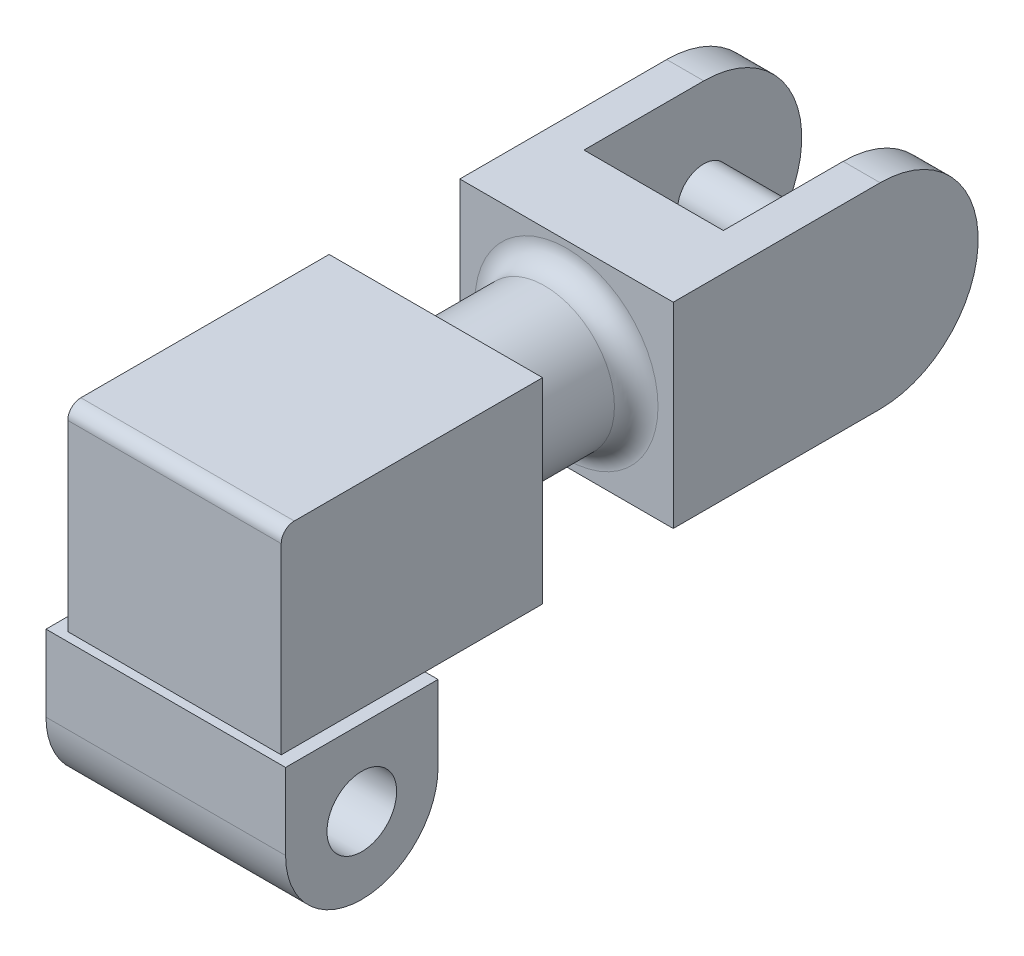
ISO-10303-21;
HEADER;
FILE_DESCRIPTION(('STEP AP214'),'2;1');
FILE_NAME('part.step','',(''),(''),'','','');
FILE_SCHEMA(('AUTOMOTIVE_DESIGN { 1 0 10303 214 1 1 1 1 }'));
ENDSEC;
DATA;
#1=APPLICATION_CONTEXT('core data for automotive mechanical design processes');
#2=APPLICATION_PROTOCOL_DEFINITION('international standard','automotive_design',2000,#1);
#3=PRODUCT_CONTEXT('',#1,'mechanical');
#4=PRODUCT('Part','Part','',(#3));
#5=PRODUCT_RELATED_PRODUCT_CATEGORY('part','',(#4));
#6=PRODUCT_DEFINITION_FORMATION('','',#4);
#7=PRODUCT_DEFINITION_CONTEXT('part definition',#1,'design');
#8=PRODUCT_DEFINITION('design','',#6,#7);
#9=PRODUCT_DEFINITION_SHAPE('','',#8);
#10=(LENGTH_UNIT() NAMED_UNIT(*) SI_UNIT(.MILLI.,.METRE.));
#11=(NAMED_UNIT(*) PLANE_ANGLE_UNIT() SI_UNIT($,.RADIAN.));
#12=(NAMED_UNIT(*) SI_UNIT($,.STERADIAN.) SOLID_ANGLE_UNIT());
#13=UNCERTAINTY_MEASURE_WITH_UNIT(LENGTH_MEASURE(1.E-05),#10,'distance_accuracy_value','');
#14=(GEOMETRIC_REPRESENTATION_CONTEXT(3) GLOBAL_UNCERTAINTY_ASSIGNED_CONTEXT((#13)) GLOBAL_UNIT_ASSIGNED_CONTEXT((#10,
#11,#12)) REPRESENTATION_CONTEXT('',''));
#15=CARTESIAN_POINT('',(0.,0.,0.));
#16=DIRECTION('',(0.,0.,1.));
#17=DIRECTION('',(1.,0.,0.));
#18=AXIS2_PLACEMENT_3D('',#15,#16,#17);
#19=CARTESIAN_POINT('',(-24.5,40.,-122.));
#20=DIRECTION('',(1.,0.,0.));
#21=DIRECTION('',(0.,0.,-1.));
#22=AXIS2_PLACEMENT_3D('',#19,#20,#21);
#23=CYLINDRICAL_SURFACE('',#22,22.5);
#24=DIRECTION('',(-1.,0.,0.));
#25=VECTOR('',#24,1.);
#26=CARTESIAN_POINT('',(24.5,17.5,-122.));
#27=LINE('',#26,#25);
#28=CARTESIAN_POINT('',(24.5,17.5,-122.));
#29=VERTEX_POINT('',#28);
#30=CARTESIAN_POINT('',(16.,17.5,-122.));
#31=VERTEX_POINT('',#30);
#32=EDGE_CURVE('E205',#29,#31,#27,.T.);
#33=ORIENTED_EDGE('',*,*,#32,.T.);
#34=CARTESIAN_POINT('',(16.,40.,-122.));
#35=DIRECTION('',(1.,0.,0.));
#36=DIRECTION('',(0.,0.,-1.));
#37=AXIS2_PLACEMENT_3D('',#34,#35,#36);
#38=CIRCLE('',#37,22.5);
#39=CARTESIAN_POINT('',(16.,62.5,-122.));
#40=VERTEX_POINT('',#39);
#41=EDGE_CURVE('E172',#40,#31,#38,.F.);
#42=ORIENTED_EDGE('',*,*,#41,.F.);
#43=DIRECTION('',(1.,0.,0.));
#44=VECTOR('',#43,1.);
#45=CARTESIAN_POINT('',(24.5,62.5,-122.));
#46=LINE('',#45,#44);
#47=CARTESIAN_POINT('',(24.5,62.5,-122.));
#48=VERTEX_POINT('',#47);
#49=EDGE_CURVE('E186',#40,#48,#46,.T.);
#50=ORIENTED_EDGE('',*,*,#49,.T.);
#51=CARTESIAN_POINT('',(24.5,40.,-122.));
#52=DIRECTION('',(1.,0.,0.));
#53=DIRECTION('',(0.,0.,-1.));
#54=AXIS2_PLACEMENT_3D('',#51,#52,#53);
#55=CIRCLE('',#54,22.5);
#56=EDGE_CURVE('E171',#29,#48,#55,.T.);
#57=ORIENTED_EDGE('',*,*,#56,.F.);
#58=EDGE_LOOP('',(#33,#42,#50,#57));
#59=FACE_BOUND('',#58,.T.);
#60=ADVANCED_FACE('F36',(#59),#23,.T.);
#61=CARTESIAN_POINT('',(27.5,17.5,17.5));
#62=DIRECTION('',(0.,-1.,0.));
#63=DIRECTION('',(0.,0.,-1.));
#64=AXIS2_PLACEMENT_3D('',#61,#62,#63);
#65=PLANE('',#64);
#66=DIRECTION('',(0.,0.,-1.));
#67=VECTOR('',#66,1.);
#68=CARTESIAN_POINT('',(24.5,17.5,15.5));
#69=LINE('',#68,#67);
#70=CARTESIAN_POINT('',(24.5,17.5,15.5));
#71=VERTEX_POINT('',#70);
#72=CARTESIAN_POINT('',(24.5,17.5,-17.5));
#73=VERTEX_POINT('',#72);
#74=EDGE_CURVE('E238',#71,#73,#69,.T.);
#75=ORIENTED_EDGE('',*,*,#74,.F.);
#76=DIRECTION('',(1.,0.,0.));
#77=VECTOR('',#76,1.);
#78=CARTESIAN_POINT('',(-24.5,17.5,15.5));
#79=LINE('',#78,#77);
#80=CARTESIAN_POINT('',(-24.5,17.5,15.5));
#81=VERTEX_POINT('',#80);
#82=EDGE_CURVE('E232',#81,#71,#79,.T.);
#83=ORIENTED_EDGE('',*,*,#82,.F.);
#84=DIRECTION('',(0.,0.,1.));
#85=VECTOR('',#84,1.);
#86=CARTESIAN_POINT('',(-24.5,17.5,15.5));
#87=LINE('',#86,#85);
#88=CARTESIAN_POINT('',(-24.5,17.5,-17.5));
#89=VERTEX_POINT('',#88);
#90=EDGE_CURVE('E246',#89,#81,#87,.T.);
#91=ORIENTED_EDGE('',*,*,#90,.F.);
#92=DIRECTION('',(-1.,0.,0.));
#93=VECTOR('',#92,1.);
#94=CARTESIAN_POINT('',(27.5,17.5,-17.5));
#95=LINE('',#94,#93);
#96=CARTESIAN_POINT('',(-27.5,17.5,-17.5));
#97=VERTEX_POINT('',#96);
#98=EDGE_CURVE('E289',#89,#97,#95,.T.);
#99=ORIENTED_EDGE('',*,*,#98,.T.);
#100=DIRECTION('',(0.,0.,1.));
#101=VECTOR('',#100,1.);
#102=CARTESIAN_POINT('',(-27.5,17.5,17.5));
#103=LINE('',#102,#101);
#104=CARTESIAN_POINT('',(-27.5,17.5,17.5));
#105=VERTEX_POINT('',#104);
#106=EDGE_CURVE('E281',#97,#105,#103,.T.);
#107=ORIENTED_EDGE('',*,*,#106,.T.);
#108=DIRECTION('',(-1.,0.,0.));
#109=VECTOR('',#108,1.);
#110=CARTESIAN_POINT('',(27.5,17.5,17.5));
#111=LINE('',#110,#109);
#112=CARTESIAN_POINT('',(27.5,17.5,17.5));
#113=VERTEX_POINT('',#112);
#114=EDGE_CURVE('E286',#113,#105,#111,.T.);
#115=ORIENTED_EDGE('',*,*,#114,.F.);
#116=DIRECTION('',(0.,0.,1.));
#117=VECTOR('',#116,1.);
#118=CARTESIAN_POINT('',(27.5,17.5,17.5));
#119=LINE('',#118,#117);
#120=CARTESIAN_POINT('',(27.5,17.5,-17.5));
#121=VERTEX_POINT('',#120);
#122=EDGE_CURVE('E271',#121,#113,#119,.T.);
#123=ORIENTED_EDGE('',*,*,#122,.F.);
#124=EDGE_CURVE('E290',#121,#73,#95,.T.);
#125=ORIENTED_EDGE('',*,*,#124,.T.);
#126=EDGE_LOOP('',(#75,#83,#91,#99,#107,#115,#123,#125));
#127=FACE_BOUND('',#126,.T.);
#128=ADVANCED_FACE('F338',(#127),#65,.F.);
#129=CARTESIAN_POINT('',(27.5,0.,0.));
#130=DIRECTION('',(1.,0.,0.));
#131=DIRECTION('',(0.,0.,-1.));
#132=AXIS2_PLACEMENT_3D('',#129,#130,#131);
#133=PLANE('',#132);
#134=CARTESIAN_POINT('',(27.5,0.,0.));
#135=DIRECTION('',(1.,0.,0.));
#136=DIRECTION('',(0.,0.,-1.));
#137=AXIS2_PLACEMENT_3D('',#134,#135,#136);
#138=CIRCLE('',#137,17.5);
#139=CARTESIAN_POINT('',(27.5,0.,17.5));
#140=VERTEX_POINT('',#139);
#141=CARTESIAN_POINT('',(27.5,0.,-17.5));
#142=VERTEX_POINT('',#141);
#143=EDGE_CURVE('E265',#140,#142,#138,.T.);
#144=ORIENTED_EDGE('',*,*,#143,.T.);
#145=DIRECTION('',(0.,1.,0.));
#146=VECTOR('',#145,1.);
#147=CARTESIAN_POINT('',(27.5,17.5,-17.5));
#148=LINE('',#147,#146);
#149=EDGE_CURVE('E268',#142,#121,#148,.T.);
#150=ORIENTED_EDGE('',*,*,#149,.T.);
#151=ORIENTED_EDGE('',*,*,#122,.T.);
#152=DIRECTION('',(0.,-1.,0.));
#153=VECTOR('',#152,1.);
#154=CARTESIAN_POINT('',(27.5,0.,17.5));
#155=LINE('',#154,#153);
#156=EDGE_CURVE('E273',#113,#140,#155,.T.);
#157=ORIENTED_EDGE('',*,*,#156,.T.);
#158=EDGE_LOOP('',(#144,#150,#151,#157));
#159=FACE_BOUND('',#158,.T.);
#160=CARTESIAN_POINT('',(27.5,0.,0.));
#161=DIRECTION('',(1.,0.,0.));
#162=DIRECTION('',(0.,0.,-1.));
#163=AXIS2_PLACEMENT_3D('',#160,#161,#162);
#164=CIRCLE('',#163,8.);
#165=CARTESIAN_POINT('',(27.5,0.,-8.));
#166=VERTEX_POINT('',#165);
#167=EDGE_CURVE('E259',#166,#166,#164,.T.);
#168=ORIENTED_EDGE('',*,*,#167,.F.);
#169=EDGE_LOOP('',(#168));
#170=FACE_BOUND('',#169,.T.);
#171=ADVANCED_FACE('F345',(#159,#170),#133,.T.);
#172=CARTESIAN_POINT('',(-27.5,0.,0.));
#173=DIRECTION('',(1.,0.,0.));
#174=DIRECTION('',(0.,0.,-1.));
#175=AXIS2_PLACEMENT_3D('',#172,#173,#174);
#176=PLANE('',#175);
#177=CARTESIAN_POINT('',(-27.5,0.,0.));
#178=DIRECTION('',(1.,0.,0.));
#179=DIRECTION('',(0.,0.,-1.));
#180=AXIS2_PLACEMENT_3D('',#177,#178,#179);
#181=CIRCLE('',#180,17.5);
#182=CARTESIAN_POINT('',(-27.5,0.,17.5));
#183=VERTEX_POINT('',#182);
#184=CARTESIAN_POINT('',(-27.5,0.,-17.5));
#185=VERTEX_POINT('',#184);
#186=EDGE_CURVE('E262',#183,#185,#181,.T.);
#187=ORIENTED_EDGE('',*,*,#186,.F.);
#188=DIRECTION('',(0.,-1.,0.));
#189=VECTOR('',#188,1.);
#190=CARTESIAN_POINT('',(-27.5,0.,17.5));
#191=LINE('',#190,#189);
#192=EDGE_CURVE('E269',#105,#183,#191,.T.);
#193=ORIENTED_EDGE('',*,*,#192,.F.);
#194=ORIENTED_EDGE('',*,*,#106,.F.);
#195=DIRECTION('',(0.,1.,0.));
#196=VECTOR('',#195,1.);
#197=CARTESIAN_POINT('',(-27.5,17.5,-17.5));
#198=LINE('',#197,#196);
#199=EDGE_CURVE('E278',#185,#97,#198,.T.);
#200=ORIENTED_EDGE('',*,*,#199,.F.);
#201=EDGE_LOOP('',(#187,#193,#194,#200));
#202=FACE_BOUND('',#201,.T.);
#203=CARTESIAN_POINT('',(-27.5,0.,0.));
#204=DIRECTION('',(1.,0.,0.));
#205=DIRECTION('',(0.,0.,-1.));
#206=AXIS2_PLACEMENT_3D('',#203,#204,#205);
#207=CIRCLE('',#206,8.);
#208=CARTESIAN_POINT('',(-27.5,0.,-8.));
#209=VERTEX_POINT('',#208);
#210=EDGE_CURVE('E258',#209,#209,#207,.T.);
#211=ORIENTED_EDGE('',*,*,#210,.T.);
#212=EDGE_LOOP('',(#211));
#213=FACE_BOUND('',#212,.T.);
#214=ADVANCED_FACE('F420',(#202,#213),#176,.F.);
#215=CARTESIAN_POINT('',(27.5,0.,0.));
#216=DIRECTION('',(-1.,0.,0.));
#217=DIRECTION('',(0.,0.,1.));
#218=AXIS2_PLACEMENT_3D('',#215,#216,#217);
#219=CYLINDRICAL_SURFACE('',#218,17.5);
#220=ORIENTED_EDGE('',*,*,#186,.T.);
#221=DIRECTION('',(-1.,0.,0.));
#222=VECTOR('',#221,1.);
#223=CARTESIAN_POINT('',(27.5,0.,-17.5));
#224=LINE('',#223,#222);
#225=EDGE_CURVE('E293',#142,#185,#224,.T.);
#226=ORIENTED_EDGE('',*,*,#225,.F.);
#227=ORIENTED_EDGE('',*,*,#143,.F.);
#228=DIRECTION('',(-1.,0.,0.));
#229=VECTOR('',#228,1.);
#230=CARTESIAN_POINT('',(27.5,0.,17.5));
#231=LINE('',#230,#229);
#232=EDGE_CURVE('E275',#140,#183,#231,.T.);
#233=ORIENTED_EDGE('',*,*,#232,.T.);
#234=EDGE_LOOP('',(#220,#226,#227,#233));
#235=FACE_BOUND('',#234,.T.);
#236=ADVANCED_FACE('F424',(#235),#219,.T.);
#237=CARTESIAN_POINT('',(27.5,17.5,-17.5));
#238=DIRECTION('',(0.,0.,1.));
#239=DIRECTION('',(1.,0.,0.));
#240=AXIS2_PLACEMENT_3D('',#237,#238,#239);
#241=PLANE('',#240);
#242=ORIENTED_EDGE('',*,*,#199,.T.);
#243=ORIENTED_EDGE('',*,*,#98,.F.);
#244=EDGE_CURVE('E294',#73,#89,#95,.T.);
#245=ORIENTED_EDGE('',*,*,#244,.F.);
#246=ORIENTED_EDGE('',*,*,#124,.F.);
#247=ORIENTED_EDGE('',*,*,#149,.F.);
#248=ORIENTED_EDGE('',*,*,#225,.T.);
#249=EDGE_LOOP('',(#242,#243,#245,#246,#247,#248));
#250=FACE_BOUND('',#249,.T.);
#251=ADVANCED_FACE('F427',(#250),#241,.F.);
#252=CARTESIAN_POINT('',(27.5,0.,17.5));
#253=DIRECTION('',(0.,0.,-1.));
#254=DIRECTION('',(-1.,0.,0.));
#255=AXIS2_PLACEMENT_3D('',#252,#253,#254);
#256=PLANE('',#255);
#257=ORIENTED_EDGE('',*,*,#192,.T.);
#258=ORIENTED_EDGE('',*,*,#232,.F.);
#259=ORIENTED_EDGE('',*,*,#156,.F.);
#260=ORIENTED_EDGE('',*,*,#114,.T.);
#261=EDGE_LOOP('',(#257,#258,#259,#260));
#262=FACE_BOUND('',#261,.T.);
#263=ADVANCED_FACE('F416',(#262),#256,.F.);
#264=CARTESIAN_POINT('',(27.5,0.,0.));
#265=DIRECTION('',(-1.,0.,0.));
#266=DIRECTION('',(0.,0.,1.));
#267=AXIS2_PLACEMENT_3D('',#264,#265,#266);
#268=CYLINDRICAL_SURFACE('',#267,8.);
#269=ORIENTED_EDGE('',*,*,#167,.T.);
#270=EDGE_LOOP('',(#269));
#271=FACE_BOUND('',#270,.T.);
#272=ORIENTED_EDGE('',*,*,#210,.F.);
#273=EDGE_LOOP('',(#272));
#274=FACE_BOUND('',#273,.T.);
#275=ADVANCED_FACE('F413',(#271,#274),#268,.F.);
#276=CARTESIAN_POINT('',(24.5,62.5,15.5));
#277=DIRECTION('',(-1.,0.,0.));
#278=DIRECTION('',(0.,0.,1.));
#279=AXIS2_PLACEMENT_3D('',#276,#277,#278);
#280=PLANE('',#279);
#281=DIRECTION('',(0.,0.,-1.));
#282=VECTOR('',#281,1.);
#283=CARTESIAN_POINT('',(24.5,62.5,15.5));
#284=LINE('',#283,#282);
#285=CARTESIAN_POINT('',(24.5,62.5,12.5));
#286=VERTEX_POINT('',#285);
#287=CARTESIAN_POINT('',(24.5,62.5,-44.5));
#288=VERTEX_POINT('',#287);
#289=EDGE_CURVE('E229',#286,#288,#284,.T.);
#290=ORIENTED_EDGE('',*,*,#289,.F.);
#291=CARTESIAN_POINT('',(24.5,59.5,12.5));
#292=DIRECTION('',(-1.,0.,0.));
#293=DIRECTION('',(0.,0.,1.));
#294=AXIS2_PLACEMENT_3D('',#291,#292,#293);
#295=CIRCLE('',#294,3.);
#296=CARTESIAN_POINT('',(24.5,59.5,15.5));
#297=VERTEX_POINT('',#296);
#298=EDGE_CURVE('E59',#286,#297,#295,.F.);
#299=ORIENTED_EDGE('',*,*,#298,.T.);
#300=DIRECTION('',(0.,-1.,0.));
#301=VECTOR('',#300,1.);
#302=CARTESIAN_POINT('',(24.5,62.5,15.5));
#303=LINE('',#302,#301);
#304=EDGE_CURVE('E237',#297,#71,#303,.T.);
#305=ORIENTED_EDGE('',*,*,#304,.T.);
#306=ORIENTED_EDGE('',*,*,#74,.T.);
#307=CARTESIAN_POINT('',(24.5,17.5,-44.5));
#308=VERTEX_POINT('',#307);
#309=EDGE_CURVE('E228',#73,#308,#69,.T.);
#310=ORIENTED_EDGE('',*,*,#309,.T.);
#311=DIRECTION('',(0.,-1.,0.));
#312=VECTOR('',#311,1.);
#313=CARTESIAN_POINT('',(24.5,62.5,-44.5));
#314=LINE('',#313,#312);
#315=EDGE_CURVE('E255',#288,#308,#314,.T.);
#316=ORIENTED_EDGE('',*,*,#315,.F.);
#317=EDGE_LOOP('',(#290,#299,#305,#306,#310,#316));
#318=FACE_BOUND('',#317,.T.);
#319=ADVANCED_FACE('F409',(#318),#280,.F.);
#320=CARTESIAN_POINT('',(-24.5,62.5,-44.5));
#321=DIRECTION('',(0.,0.,1.));
#322=DIRECTION('',(1.,0.,0.));
#323=AXIS2_PLACEMENT_3D('',#320,#321,#322);
#324=PLANE('',#323);
#325=CARTESIAN_POINT('',(0.,40.,-44.5));
#326=DIRECTION('',(0.,0.,1.));
#327=DIRECTION('',(1.,0.,0.));
#328=AXIS2_PLACEMENT_3D('',#325,#326,#327);
#329=CIRCLE('',#328,21.);
#330=CARTESIAN_POINT('',(21.,40.,-44.5));
#331=VERTEX_POINT('',#330);
#332=EDGE_CURVE('E302',#331,#331,#329,.T.);
#333=ORIENTED_EDGE('',*,*,#332,.T.);
#334=EDGE_LOOP('',(#333));
#335=FACE_BOUND('',#334,.T.);
#336=DIRECTION('',(-1.,0.,0.));
#337=VECTOR('',#336,1.);
#338=CARTESIAN_POINT('',(-24.5,17.5,-44.5));
#339=LINE('',#338,#337);
#340=CARTESIAN_POINT('',(-24.5,17.5,-44.5));
#341=VERTEX_POINT('',#340);
#342=EDGE_CURVE('E241',#308,#341,#339,.T.);
#343=ORIENTED_EDGE('',*,*,#342,.T.);
#344=DIRECTION('',(0.,-1.,0.));
#345=VECTOR('',#344,1.);
#346=CARTESIAN_POINT('',(-24.5,62.5,-44.5));
#347=LINE('',#346,#345);
#348=CARTESIAN_POINT('',(-24.5,62.5,-44.5));
#349=VERTEX_POINT('',#348);
#350=EDGE_CURVE('E252',#349,#341,#347,.T.);
#351=ORIENTED_EDGE('',*,*,#350,.F.);
#352=DIRECTION('',(-1.,0.,0.));
#353=VECTOR('',#352,1.);
#354=CARTESIAN_POINT('',(-24.5,62.5,-44.5));
#355=LINE('',#354,#353);
#356=EDGE_CURVE('E231',#288,#349,#355,.T.);
#357=ORIENTED_EDGE('',*,*,#356,.F.);
#358=ORIENTED_EDGE('',*,*,#315,.T.);
#359=EDGE_LOOP('',(#343,#351,#357,#358));
#360=FACE_BOUND('',#359,.T.);
#361=ADVANCED_FACE('F405',(#335,#360),#324,.F.);
#362=CARTESIAN_POINT('',(-24.5,62.5,15.5));
#363=DIRECTION('',(1.,0.,0.));
#364=DIRECTION('',(0.,0.,-1.));
#365=AXIS2_PLACEMENT_3D('',#362,#363,#364);
#366=PLANE('',#365);
#367=DIRECTION('',(0.,-1.,0.));
#368=VECTOR('',#367,1.);
#369=CARTESIAN_POINT('',(-24.5,62.5,15.5));
#370=LINE('',#369,#368);
#371=CARTESIAN_POINT('',(-24.5,59.5,15.5));
#372=VERTEX_POINT('',#371);
#373=EDGE_CURVE('E250',#372,#81,#370,.T.);
#374=ORIENTED_EDGE('',*,*,#373,.F.);
#375=CARTESIAN_POINT('',(-24.5,59.5,12.5));
#376=DIRECTION('',(1.,0.,0.));
#377=DIRECTION('',(0.,0.,-1.));
#378=AXIS2_PLACEMENT_3D('',#375,#376,#377);
#379=CIRCLE('',#378,3.);
#380=CARTESIAN_POINT('',(-24.5,62.5,12.5));
#381=VERTEX_POINT('',#380);
#382=EDGE_CURVE('E316',#372,#381,#379,.F.);
#383=ORIENTED_EDGE('',*,*,#382,.T.);
#384=DIRECTION('',(0.,0.,1.));
#385=VECTOR('',#384,1.);
#386=CARTESIAN_POINT('',(-24.5,62.5,15.5));
#387=LINE('',#386,#385);
#388=EDGE_CURVE('E234',#349,#381,#387,.T.);
#389=ORIENTED_EDGE('',*,*,#388,.F.);
#390=ORIENTED_EDGE('',*,*,#350,.T.);
#391=EDGE_CURVE('E243',#341,#89,#87,.T.);
#392=ORIENTED_EDGE('',*,*,#391,.T.);
#393=ORIENTED_EDGE('',*,*,#90,.T.);
#394=EDGE_LOOP('',(#374,#383,#389,#390,#392,#393));
#395=FACE_BOUND('',#394,.T.);
#396=ADVANCED_FACE('F402',(#395),#366,.F.);
#397=CARTESIAN_POINT('',(-24.5,62.5,15.5));
#398=DIRECTION('',(0.,0.,-1.));
#399=DIRECTION('',(-1.,0.,0.));
#400=AXIS2_PLACEMENT_3D('',#397,#398,#399);
#401=PLANE('',#400);
#402=ORIENTED_EDGE('',*,*,#304,.F.);
#403=DIRECTION('',(1.,0.,0.));
#404=VECTOR('',#403,1.);
#405=CARTESIAN_POINT('',(-24.5,59.5,15.5));
#406=LINE('',#405,#404);
#407=EDGE_CURVE('E51',#297,#372,#406,.F.);
#408=ORIENTED_EDGE('',*,*,#407,.T.);
#409=ORIENTED_EDGE('',*,*,#373,.T.);
#410=ORIENTED_EDGE('',*,*,#82,.T.);
#411=EDGE_LOOP('',(#402,#408,#409,#410));
#412=FACE_BOUND('',#411,.T.);
#413=ADVANCED_FACE('F395',(#412),#401,.F.);
#414=CARTESIAN_POINT('',(0.,62.5,0.));
#415=DIRECTION('',(0.,-1.,0.));
#416=DIRECTION('',(0.,0.,-1.));
#417=AXIS2_PLACEMENT_3D('',#414,#415,#416);
#418=PLANE('',#417);
#419=ORIENTED_EDGE('',*,*,#388,.T.);
#420=DIRECTION('',(1.,0.,0.));
#421=VECTOR('',#420,1.);
#422=CARTESIAN_POINT('',(0.,62.5,12.5));
#423=LINE('',#422,#421);
#424=EDGE_CURVE('E311',#381,#286,#423,.T.);
#425=ORIENTED_EDGE('',*,*,#424,.T.);
#426=ORIENTED_EDGE('',*,*,#289,.T.);
#427=ORIENTED_EDGE('',*,*,#356,.T.);
#428=EDGE_LOOP('',(#419,#425,#426,#427));
#429=FACE_BOUND('',#428,.T.);
#430=ADVANCED_FACE('F392',(#429),#418,.F.);
#431=CARTESIAN_POINT('',(0.,17.5,0.));
#432=DIRECTION('',(0.,-1.,0.));
#433=DIRECTION('',(0.,0.,-1.));
#434=AXIS2_PLACEMENT_3D('',#431,#432,#433);
#435=PLANE('',#434);
#436=ORIENTED_EDGE('',*,*,#309,.F.);
#437=ORIENTED_EDGE('',*,*,#244,.T.);
#438=ORIENTED_EDGE('',*,*,#391,.F.);
#439=ORIENTED_EDGE('',*,*,#342,.F.);
#440=EDGE_LOOP('',(#436,#437,#438,#439));
#441=FACE_BOUND('',#440,.T.);
#442=ADVANCED_FACE('F390',(#441),#435,.T.);
#443=CARTESIAN_POINT('',(0.,40.,-74.5));
#444=DIRECTION('',(0.,0.,1.));
#445=DIRECTION('',(1.,0.,0.));
#446=AXIS2_PLACEMENT_3D('',#443,#444,#445);
#447=CYLINDRICAL_SURFACE('',#446,16.);
#448=CARTESIAN_POINT('',(0.,40.,-69.5));
#449=DIRECTION('',(0.,0.,1.));
#450=DIRECTION('',(1.,0.,0.));
#451=AXIS2_PLACEMENT_3D('',#448,#449,#450);
#452=CIRCLE('',#451,16.);
#453=CARTESIAN_POINT('',(16.,40.,-69.5));
#454=VERTEX_POINT('',#453);
#455=EDGE_CURVE('E308',#454,#454,#452,.T.);
#456=ORIENTED_EDGE('',*,*,#455,.T.);
#457=EDGE_LOOP('',(#456));
#458=FACE_BOUND('',#457,.T.);
#459=CARTESIAN_POINT('',(0.,40.,-49.5));
#460=DIRECTION('',(0.,0.,1.));
#461=DIRECTION('',(1.,0.,0.));
#462=AXIS2_PLACEMENT_3D('',#459,#460,#461);
#463=CIRCLE('',#462,16.);
#464=CARTESIAN_POINT('',(16.,40.,-49.5));
#465=VERTEX_POINT('',#464);
#466=EDGE_CURVE('E299',#465,#465,#463,.F.);
#467=ORIENTED_EDGE('',*,*,#466,.T.);
#468=EDGE_LOOP('',(#467));
#469=FACE_BOUND('',#468,.T.);
#470=ADVANCED_FACE('F387',(#458,#469),#447,.T.);
#471=CARTESIAN_POINT('',(-24.5,17.5,-122.));
#472=DIRECTION('',(1.,0.,0.));
#473=DIRECTION('',(0.,0.,-1.));
#474=AXIS2_PLACEMENT_3D('',#471,#472,#473);
#475=PLANE('',#474);
#476=DIRECTION('',(0.,1.,0.));
#477=VECTOR('',#476,1.);
#478=CARTESIAN_POINT('',(-24.5,17.5,-74.5));
#479=LINE('',#478,#477);
#480=CARTESIAN_POINT('',(-24.5,17.5,-74.5));
#481=VERTEX_POINT('',#480);
#482=CARTESIAN_POINT('',(-24.5,62.5,-74.5));
#483=VERTEX_POINT('',#482);
#484=EDGE_CURVE('E198',#481,#483,#479,.T.);
#485=ORIENTED_EDGE('',*,*,#484,.T.);
#486=DIRECTION('',(0.,0.,1.));
#487=VECTOR('',#486,1.);
#488=CARTESIAN_POINT('',(-24.5,62.5,-122.));
#489=LINE('',#488,#487);
#490=CARTESIAN_POINT('',(-24.5,62.5,-122.));
#491=VERTEX_POINT('',#490);
#492=EDGE_CURVE('E225',#491,#483,#489,.T.);
#493=ORIENTED_EDGE('',*,*,#492,.F.);
#494=CARTESIAN_POINT('',(-24.5,40.,-122.));
#495=DIRECTION('',(1.,0.,0.));
#496=DIRECTION('',(0.,0.,-1.));
#497=AXIS2_PLACEMENT_3D('',#494,#495,#496);
#498=CIRCLE('',#497,22.5);
#499=CARTESIAN_POINT('',(-24.5,17.5,-122.));
#500=VERTEX_POINT('',#499);
#501=EDGE_CURVE('E195',#500,#491,#498,.T.);
#502=ORIENTED_EDGE('',*,*,#501,.F.);
#503=DIRECTION('',(0.,0.,1.));
#504=VECTOR('',#503,1.);
#505=CARTESIAN_POINT('',(-24.5,17.5,-122.));
#506=LINE('',#505,#504);
#507=EDGE_CURVE('E208',#500,#481,#506,.T.);
#508=ORIENTED_EDGE('',*,*,#507,.T.);
#509=EDGE_LOOP('',(#485,#493,#502,#508));
#510=FACE_BOUND('',#509,.T.);
#511=ADVANCED_FACE('F364',(#510),#475,.F.);
#512=CARTESIAN_POINT('',(24.5,62.5,-122.));
#513=DIRECTION('',(0.,-1.,0.));
#514=DIRECTION('',(0.,0.,-1.));
#515=AXIS2_PLACEMENT_3D('',#512,#513,#514);
#516=PLANE('',#515);
#517=DIRECTION('',(1.,0.,0.));
#518=VECTOR('',#517,1.);
#519=CARTESIAN_POINT('',(-12.3971223726001,62.5,-94.5));
#520=LINE('',#519,#518);
#521=CARTESIAN_POINT('',(-16.,62.5,-94.5));
#522=VERTEX_POINT('',#521);
#523=CARTESIAN_POINT('',(16.,62.5,-94.5));
#524=VERTEX_POINT('',#523);
#525=EDGE_CURVE('E161',#522,#524,#520,.T.);
#526=ORIENTED_EDGE('',*,*,#525,.F.);
#527=DIRECTION('',(0.,0.,1.));
#528=VECTOR('',#527,1.);
#529=CARTESIAN_POINT('',(-16.,62.5,-94.5));
#530=LINE('',#529,#528);
#531=CARTESIAN_POINT('',(-16.,62.5,-122.));
#532=VERTEX_POINT('',#531);
#533=EDGE_CURVE('E181',#532,#522,#530,.T.);
#534=ORIENTED_EDGE('',*,*,#533,.F.);
#535=EDGE_CURVE('E201',#491,#532,#46,.T.);
#536=ORIENTED_EDGE('',*,*,#535,.F.);
#537=ORIENTED_EDGE('',*,*,#492,.T.);
#538=DIRECTION('',(1.,0.,0.));
#539=VECTOR('',#538,1.);
#540=CARTESIAN_POINT('',(24.5,62.5,-74.5));
#541=LINE('',#540,#539);
#542=CARTESIAN_POINT('',(24.5,62.5,-74.5));
#543=VERTEX_POINT('',#542);
#544=EDGE_CURVE('E211',#483,#543,#541,.T.);
#545=ORIENTED_EDGE('',*,*,#544,.T.);
#546=DIRECTION('',(0.,0.,1.));
#547=VECTOR('',#546,1.);
#548=CARTESIAN_POINT('',(24.5,62.5,-122.));
#549=LINE('',#548,#547);
#550=EDGE_CURVE('E222',#48,#543,#549,.T.);
#551=ORIENTED_EDGE('',*,*,#550,.F.);
#552=ORIENTED_EDGE('',*,*,#49,.F.);
#553=DIRECTION('',(0.,0.,-1.));
#554=VECTOR('',#553,1.);
#555=CARTESIAN_POINT('',(16.,62.5,-94.5));
#556=LINE('',#555,#554);
#557=EDGE_CURVE('E177',#524,#40,#556,.T.);
#558=ORIENTED_EDGE('',*,*,#557,.F.);
#559=EDGE_LOOP('',(#526,#534,#536,#537,#545,#551,#552,#558));
#560=FACE_BOUND('',#559,.T.);
#561=ADVANCED_FACE('F184',(#560),#516,.F.);
#562=CARTESIAN_POINT('',(24.5,17.5,-122.));
#563=DIRECTION('',(-1.,0.,0.));
#564=DIRECTION('',(0.,0.,1.));
#565=AXIS2_PLACEMENT_3D('',#562,#563,#564);
#566=PLANE('',#565);
#567=DIRECTION('',(0.,-1.,0.));
#568=VECTOR('',#567,1.);
#569=CARTESIAN_POINT('',(24.5,17.5,-74.5));
#570=LINE('',#569,#568);
#571=CARTESIAN_POINT('',(24.5,17.5,-74.5));
#572=VERTEX_POINT('',#571);
#573=EDGE_CURVE('E213',#543,#572,#570,.T.);
#574=ORIENTED_EDGE('',*,*,#573,.T.);
#575=DIRECTION('',(0.,0.,1.));
#576=VECTOR('',#575,1.);
#577=CARTESIAN_POINT('',(24.5,17.5,-122.));
#578=LINE('',#577,#576);
#579=EDGE_CURVE('E219',#29,#572,#578,.T.);
#580=ORIENTED_EDGE('',*,*,#579,.F.);
#581=ORIENTED_EDGE('',*,*,#56,.T.);
#582=ORIENTED_EDGE('',*,*,#550,.T.);
#583=EDGE_LOOP('',(#574,#580,#581,#582));
#584=FACE_BOUND('',#583,.T.);
#585=ADVANCED_FACE('F371',(#584),#566,.F.);
#586=CARTESIAN_POINT('',(24.5,17.5,-122.));
#587=DIRECTION('',(0.,1.,0.));
#588=DIRECTION('',(0.,0.,1.));
#589=AXIS2_PLACEMENT_3D('',#586,#587,#588);
#590=PLANE('',#589);
#591=DIRECTION('',(0.,0.,1.));
#592=VECTOR('',#591,1.);
#593=CARTESIAN_POINT('',(-16.,17.5,-122.));
#594=LINE('',#593,#592);
#595=CARTESIAN_POINT('',(-16.,17.5,-122.));
#596=VERTEX_POINT('',#595);
#597=CARTESIAN_POINT('',(-16.,17.5,-94.5));
#598=VERTEX_POINT('',#597);
#599=EDGE_CURVE('E190',#596,#598,#594,.T.);
#600=ORIENTED_EDGE('',*,*,#599,.T.);
#601=DIRECTION('',(1.,0.,0.));
#602=VECTOR('',#601,1.);
#603=CARTESIAN_POINT('',(24.5,17.5,-94.5));
#604=LINE('',#603,#602);
#605=CARTESIAN_POINT('',(16.,17.5,-94.5));
#606=VERTEX_POINT('',#605);
#607=EDGE_CURVE('E297',#598,#606,#604,.T.);
#608=ORIENTED_EDGE('',*,*,#607,.T.);
#609=DIRECTION('',(0.,0.,-1.));
#610=VECTOR('',#609,1.);
#611=CARTESIAN_POINT('',(16.,17.5,-122.));
#612=LINE('',#611,#610);
#613=EDGE_CURVE('E180',#606,#31,#612,.T.);
#614=ORIENTED_EDGE('',*,*,#613,.T.);
#615=ORIENTED_EDGE('',*,*,#32,.F.);
#616=ORIENTED_EDGE('',*,*,#579,.T.);
#617=DIRECTION('',(-1.,0.,0.));
#618=VECTOR('',#617,1.);
#619=CARTESIAN_POINT('',(24.5,17.5,-74.5));
#620=LINE('',#619,#618);
#621=EDGE_CURVE('E215',#572,#481,#620,.T.);
#622=ORIENTED_EDGE('',*,*,#621,.T.);
#623=ORIENTED_EDGE('',*,*,#507,.F.);
#624=EDGE_CURVE('E204',#596,#500,#27,.T.);
#625=ORIENTED_EDGE('',*,*,#624,.F.);
#626=EDGE_LOOP('',(#600,#608,#614,#615,#616,#622,#623,#625));
#627=FACE_BOUND('',#626,.T.);
#628=ADVANCED_FACE('F357',(#627),#590,.F.);
#629=CARTESIAN_POINT('',(0.,0.,-74.5));
#630=DIRECTION('',(0.,0.,1.));
#631=DIRECTION('',(1.,0.,0.));
#632=AXIS2_PLACEMENT_3D('',#629,#630,#631);
#633=PLANE('',#632);
#634=CARTESIAN_POINT('',(0.,40.,-74.5));
#635=DIRECTION('',(0.,0.,1.));
#636=DIRECTION('',(1.,0.,0.));
#637=AXIS2_PLACEMENT_3D('',#634,#635,#636);
#638=CIRCLE('',#637,21.);
#639=CARTESIAN_POINT('',(21.,40.,-74.5));
#640=VERTEX_POINT('',#639);
#641=EDGE_CURVE('E305',#640,#640,#638,.F.);
#642=ORIENTED_EDGE('',*,*,#641,.T.);
#643=EDGE_LOOP('',(#642));
#644=FACE_BOUND('',#643,.T.);
#645=ORIENTED_EDGE('',*,*,#484,.F.);
#646=ORIENTED_EDGE('',*,*,#621,.F.);
#647=ORIENTED_EDGE('',*,*,#573,.F.);
#648=ORIENTED_EDGE('',*,*,#544,.F.);
#649=EDGE_LOOP('',(#645,#646,#647,#648));
#650=FACE_BOUND('',#649,.T.);
#651=ADVANCED_FACE('F350',(#644,#650),#633,.T.);
#652=ORIENTED_EDGE('',*,*,#535,.T.);
#653=CARTESIAN_POINT('',(-16.,40.,-122.));
#654=DIRECTION('',(-1.,0.,0.));
#655=DIRECTION('',(0.,0.,1.));
#656=AXIS2_PLACEMENT_3D('',#653,#654,#655);
#657=CIRCLE('',#656,22.5);
#658=EDGE_CURVE('E318',#596,#532,#657,.F.);
#659=ORIENTED_EDGE('',*,*,#658,.F.);
#660=ORIENTED_EDGE('',*,*,#624,.T.);
#661=ORIENTED_EDGE('',*,*,#501,.T.);
#662=EDGE_LOOP('',(#652,#659,#660,#661));
#663=FACE_BOUND('',#662,.T.);
#664=ADVANCED_FACE('F341',(#663),#23,.T.);
#665=CARTESIAN_POINT('',(-12.3971223726001,-17.5,-94.5));
#666=DIRECTION('',(0.,0.,1.));
#667=DIRECTION('',(1.,0.,0.));
#668=AXIS2_PLACEMENT_3D('',#665,#666,#667);
#669=PLANE('',#668);
#670=ORIENTED_EDGE('',*,*,#607,.F.);
#671=DIRECTION('',(0.,1.,0.));
#672=VECTOR('',#671,1.);
#673=CARTESIAN_POINT('',(-16.,-17.5,-94.5));
#674=LINE('',#673,#672);
#675=EDGE_CURVE('E166',#598,#522,#674,.T.);
#676=ORIENTED_EDGE('',*,*,#675,.T.);
#677=ORIENTED_EDGE('',*,*,#525,.T.);
#678=DIRECTION('',(0.,1.,0.));
#679=VECTOR('',#678,1.);
#680=CARTESIAN_POINT('',(16.,-17.5,-94.5));
#681=LINE('',#680,#679);
#682=EDGE_CURVE('E164',#606,#524,#681,.T.);
#683=ORIENTED_EDGE('',*,*,#682,.F.);
#684=EDGE_LOOP('',(#670,#676,#677,#683));
#685=FACE_BOUND('',#684,.T.);
#686=ADVANCED_FACE('F163',(#685),#669,.F.);
#687=CARTESIAN_POINT('',(0.,40.,-49.5));
#688=DIRECTION('',(0.,0.,1.));
#689=DIRECTION('',(1.,0.,0.));
#690=AXIS2_PLACEMENT_3D('',#687,#688,#689);
#691=TOROIDAL_SURFACE('',#690,21.,5.);
#692=ORIENTED_EDGE('',*,*,#332,.F.);
#693=EDGE_LOOP('',(#692));
#694=FACE_BOUND('',#693,.T.);
#695=ORIENTED_EDGE('',*,*,#466,.F.);
#696=EDGE_LOOP('',(#695));
#697=FACE_BOUND('',#696,.T.);
#698=ADVANCED_FACE('F356',(#694,#697),#691,.F.);
#699=CARTESIAN_POINT('',(0.,40.,-69.5));
#700=DIRECTION('',(0.,0.,1.));
#701=DIRECTION('',(1.,0.,0.));
#702=AXIS2_PLACEMENT_3D('',#699,#700,#701);
#703=TOROIDAL_SURFACE('',#702,21.,5.);
#704=ORIENTED_EDGE('',*,*,#455,.F.);
#705=EDGE_LOOP('',(#704));
#706=FACE_BOUND('',#705,.T.);
#707=ORIENTED_EDGE('',*,*,#641,.F.);
#708=EDGE_LOOP('',(#707));
#709=FACE_BOUND('',#708,.T.);
#710=ADVANCED_FACE('F437',(#706,#709),#703,.F.);
#711=CARTESIAN_POINT('',(0.,59.5,12.5));
#712=DIRECTION('',(1.,0.,0.));
#713=DIRECTION('',(0.,0.,-1.));
#714=AXIS2_PLACEMENT_3D('',#711,#712,#713);
#715=CYLINDRICAL_SURFACE('',#714,3.);
#716=ORIENTED_EDGE('',*,*,#382,.F.);
#717=ORIENTED_EDGE('',*,*,#407,.F.);
#718=ORIENTED_EDGE('',*,*,#298,.F.);
#719=ORIENTED_EDGE('',*,*,#424,.F.);
#720=EDGE_LOOP('',(#716,#717,#718,#719));
#721=FACE_BOUND('',#720,.T.);
#722=ADVANCED_FACE('F38',(#721),#715,.T.);
#723=CARTESIAN_POINT('',(-16.,-17.5,-94.5));
#724=DIRECTION('',(-1.,0.,0.));
#725=DIRECTION('',(0.,0.,1.));
#726=AXIS2_PLACEMENT_3D('',#723,#724,#725);
#727=PLANE('',#726);
#728=CARTESIAN_POINT('',(-16.,40.,-122.));
#729=DIRECTION('',(-1.,0.,0.));
#730=DIRECTION('',(0.,0.,1.));
#731=AXIS2_PLACEMENT_3D('',#728,#729,#730);
#732=CIRCLE('',#731,6.);
#733=CARTESIAN_POINT('',(-16.,40.,-116.));
#734=VERTEX_POINT('',#733);
#735=EDGE_CURVE('E11',#734,#734,#732,.F.);
#736=ORIENTED_EDGE('',*,*,#735,.F.);
#737=EDGE_LOOP('',(#736));
#738=FACE_BOUND('',#737,.T.);
#739=ORIENTED_EDGE('',*,*,#658,.T.);
#740=ORIENTED_EDGE('',*,*,#533,.T.);
#741=ORIENTED_EDGE('',*,*,#675,.F.);
#742=ORIENTED_EDGE('',*,*,#599,.F.);
#743=EDGE_LOOP('',(#739,#740,#741,#742));
#744=FACE_BOUND('',#743,.T.);
#745=ADVANCED_FACE('F327',(#738,#744),#727,.F.);
#746=CARTESIAN_POINT('',(16.,-17.5,-94.5));
#747=DIRECTION('',(1.,0.,0.));
#748=DIRECTION('',(0.,0.,-1.));
#749=AXIS2_PLACEMENT_3D('',#746,#747,#748);
#750=PLANE('',#749);
#751=CARTESIAN_POINT('',(16.,40.,-122.));
#752=DIRECTION('',(1.,0.,0.));
#753=DIRECTION('',(0.,0.,-1.));
#754=AXIS2_PLACEMENT_3D('',#751,#752,#753);
#755=CIRCLE('',#754,6.);
#756=CARTESIAN_POINT('',(16.,40.,-128.));
#757=VERTEX_POINT('',#756);
#758=EDGE_CURVE('E44',#757,#757,#755,.F.);
#759=ORIENTED_EDGE('',*,*,#758,.F.);
#760=EDGE_LOOP('',(#759));
#761=FACE_BOUND('',#760,.T.);
#762=ORIENTED_EDGE('',*,*,#41,.T.);
#763=ORIENTED_EDGE('',*,*,#613,.F.);
#764=ORIENTED_EDGE('',*,*,#682,.T.);
#765=ORIENTED_EDGE('',*,*,#557,.T.);
#766=EDGE_LOOP('',(#762,#763,#764,#765));
#767=FACE_BOUND('',#766,.T.);
#768=ADVANCED_FACE('F176',(#761,#767),#750,.F.);
#769=CARTESIAN_POINT('',(-32.9705627484772,40.,-122.));
#770=DIRECTION('',(1.,0.,0.));
#771=DIRECTION('',(0.,0.,-1.));
#772=AXIS2_PLACEMENT_3D('',#769,#770,#771);
#773=CYLINDRICAL_SURFACE('',#772,6.);
#774=ORIENTED_EDGE('',*,*,#758,.T.);
#775=EDGE_LOOP('',(#774));
#776=FACE_BOUND('',#775,.T.);
#777=ORIENTED_EDGE('',*,*,#735,.T.);
#778=EDGE_LOOP('',(#777));
#779=FACE_BOUND('',#778,.T.);
#780=ADVANCED_FACE('F323',(#776,#779),#773,.T.);
#781=CLOSED_SHELL('',(#60,#128,#171,#214,#236,#251,#263,#275,#319,#361,#396,#413,#430,#442,#470,
#511,#561,#585,#628,#651,#664,#686,#698,#710,#722,#745,#768,#780));
#782=MANIFOLD_SOLID_BREP('B2',#781);
#783=ADVANCED_BREP_SHAPE_REPRESENTATION('',(#18,#782),#14);
#784=SHAPE_DEFINITION_REPRESENTATION(#9,#783);
ENDSEC;
END-ISO-10303-21;
